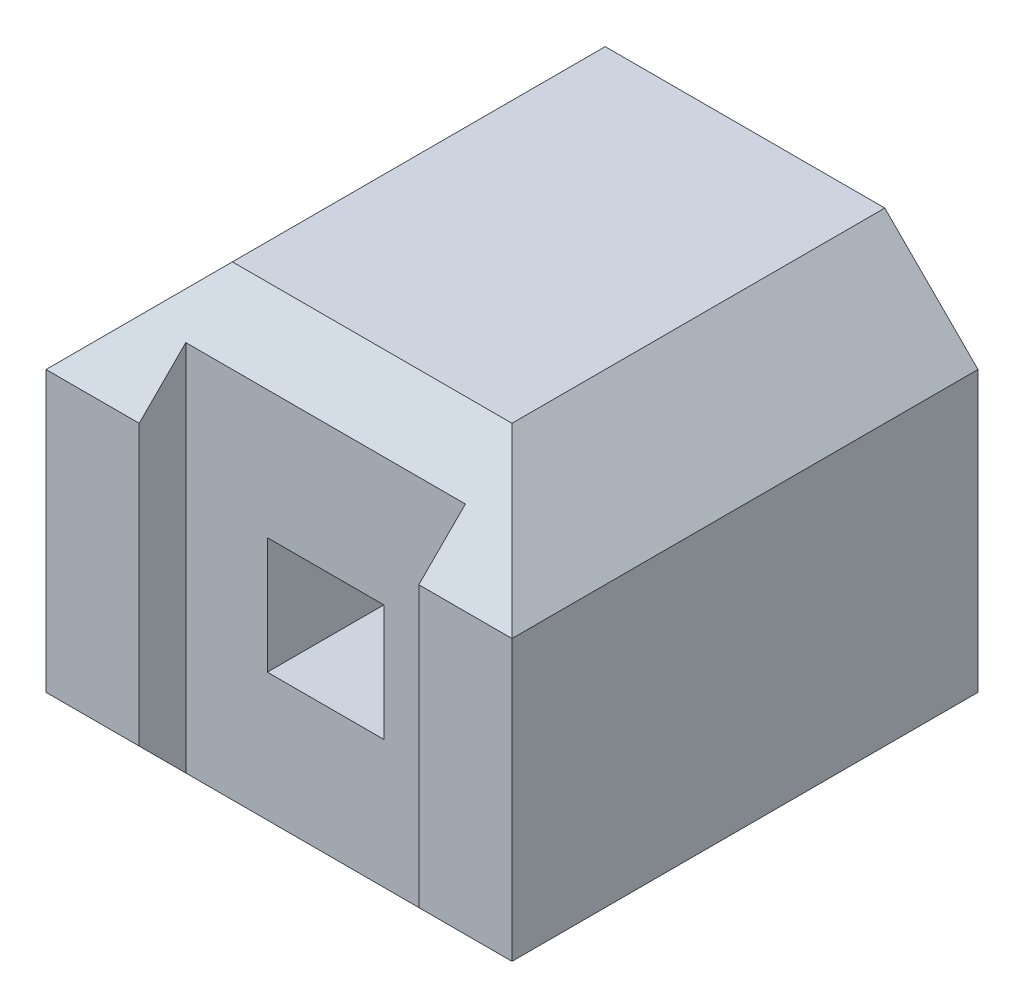
ISO-10303-21;
HEADER;
FILE_DESCRIPTION(('STEP AP214'),'2;1');
FILE_NAME('part.step','',(''),(''),'','','');
FILE_SCHEMA(('AUTOMOTIVE_DESIGN { 1 0 10303 214 1 1 1 1 }'));
ENDSEC;
DATA;
#1=APPLICATION_CONTEXT('core data for automotive mechanical design processes');
#2=APPLICATION_PROTOCOL_DEFINITION('international standard','automotive_design',2000,#1);
#3=PRODUCT_CONTEXT('',#1,'mechanical');
#4=PRODUCT('Part','Part','',(#3));
#5=PRODUCT_RELATED_PRODUCT_CATEGORY('part','',(#4));
#6=PRODUCT_DEFINITION_FORMATION('','',#4);
#7=PRODUCT_DEFINITION_CONTEXT('part definition',#1,'design');
#8=PRODUCT_DEFINITION('design','',#6,#7);
#9=PRODUCT_DEFINITION_SHAPE('','',#8);
#10=(LENGTH_UNIT() NAMED_UNIT(*) SI_UNIT(.MILLI.,.METRE.));
#11=(NAMED_UNIT(*) PLANE_ANGLE_UNIT() SI_UNIT($,.RADIAN.));
#12=(NAMED_UNIT(*) SI_UNIT($,.STERADIAN.) SOLID_ANGLE_UNIT());
#13=UNCERTAINTY_MEASURE_WITH_UNIT(LENGTH_MEASURE(1.E-05),#10,'distance_accuracy_value','');
#14=(GEOMETRIC_REPRESENTATION_CONTEXT(3) GLOBAL_UNCERTAINTY_ASSIGNED_CONTEXT((#13)) GLOBAL_UNIT_ASSIGNED_CONTEXT((#10,
#11,#12)) REPRESENTATION_CONTEXT('',''));
#15=CARTESIAN_POINT('',(0.,0.,0.));
#16=DIRECTION('',(0.,0.,1.));
#17=DIRECTION('',(1.,0.,0.));
#18=AXIS2_PLACEMENT_3D('',#15,#16,#17);
#19=CARTESIAN_POINT('',(1.27,8.89,2.54));
#20=DIRECTION('',(-1.,0.,0.));
#21=DIRECTION('',(0.,0.,1.));
#22=AXIS2_PLACEMENT_3D('',#19,#20,#21);
#23=PLANE('',#22);
#24=DIRECTION('',(0.,0.,1.));
#25=VECTOR('',#24,1.);
#26=CARTESIAN_POINT('',(1.27,10.922,2.54));
#27=LINE('',#26,#25);
#28=CARTESIAN_POINT('',(1.27,10.922,0.));
#29=VERTEX_POINT('',#28);
#30=CARTESIAN_POINT('',(1.27,10.922,2.54));
#31=VERTEX_POINT('',#30);
#32=EDGE_CURVE('E158',#29,#31,#27,.T.);
#33=ORIENTED_EDGE('',*,*,#32,.T.);
#34=DIRECTION('',(0.,1.,0.));
#35=VECTOR('',#34,1.);
#36=CARTESIAN_POINT('',(1.27,0.,2.54));
#37=LINE('',#36,#35);
#38=CARTESIAN_POINT('',(1.27,9.398,2.54));
#39=VERTEX_POINT('',#38);
#40=EDGE_CURVE('E127',#39,#31,#37,.T.);
#41=ORIENTED_EDGE('',*,*,#40,.F.);
#42=DIRECTION('',(0.,0.,1.));
#43=VECTOR('',#42,1.);
#44=CARTESIAN_POINT('',(1.27,9.398,2.54));
#45=LINE('',#44,#43);
#46=CARTESIAN_POINT('',(1.27,9.398,0.));
#47=VERTEX_POINT('',#46);
#48=EDGE_CURVE('E151',#39,#47,#45,.F.);
#49=ORIENTED_EDGE('',*,*,#48,.T.);
#50=DIRECTION('',(0.,1.,0.));
#51=VECTOR('',#50,1.);
#52=CARTESIAN_POINT('',(1.27,8.89,0.));
#53=LINE('',#52,#51);
#54=EDGE_CURVE('E19',#29,#47,#53,.F.);
#55=ORIENTED_EDGE('',*,*,#54,.F.);
#56=EDGE_LOOP('',(#33,#41,#49,#55));
#57=FACE_BOUND('',#56,.T.);
#58=ADVANCED_FACE('F16',(#57),#23,.F.);
#59=CARTESIAN_POINT('',(0.,0.,2.54));
#60=DIRECTION('',(0.,0.,1.));
#61=DIRECTION('',(1.,0.,0.));
#62=AXIS2_PLACEMENT_3D('',#59,#60,#61);
#63=PLANE('',#62);
#64=ORIENTED_EDGE('',*,*,#40,.T.);
#65=DIRECTION('',(1.,0.,0.));
#66=VECTOR('',#65,1.);
#67=CARTESIAN_POINT('',(0.,10.922,2.54));
#68=LINE('',#67,#66);
#69=CARTESIAN_POINT('',(0.762,10.922,2.54));
#70=VERTEX_POINT('',#69);
#71=EDGE_CURVE('E155',#31,#70,#68,.F.);
#72=ORIENTED_EDGE('',*,*,#71,.T.);
#73=DIRECTION('',(0.,-1.,0.));
#74=VECTOR('',#73,1.);
#75=CARTESIAN_POINT('',(0.762,11.43,2.54));
#76=LINE('',#75,#74);
#77=CARTESIAN_POINT('',(0.762,9.398,2.54));
#78=VERTEX_POINT('',#77);
#79=EDGE_CURVE('E134',#78,#70,#76,.F.);
#80=ORIENTED_EDGE('',*,*,#79,.F.);
#81=DIRECTION('',(1.,0.,0.));
#82=VECTOR('',#81,1.);
#83=CARTESIAN_POINT('',(0.,9.398,2.54));
#84=LINE('',#83,#82);
#85=EDGE_CURVE('E130',#78,#39,#84,.T.);
#86=ORIENTED_EDGE('',*,*,#85,.T.);
#87=EDGE_LOOP('',(#64,#72,#80,#86));
#88=FACE_BOUND('',#87,.T.);
#89=ADVANCED_FACE('F132',(#88),#63,.T.);
#90=CARTESIAN_POINT('',(1.27,9.398,2.54));
#91=DIRECTION('',(-0.707106781186548,0.707106781186548,0.));
#92=DIRECTION('',(-0.707106781186548,-0.707106781186548,0.));
#93=AXIS2_PLACEMENT_3D('',#90,#91,#92);
#94=PLANE('',#93);
#95=ORIENTED_EDGE('',*,*,#48,.F.);
#96=DIRECTION('',(0.577350269189626,0.577350269189626,0.577350269189626));
#97=VECTOR('',#96,1.);
#98=CARTESIAN_POINT('',(0.762,8.89,2.032));
#99=LINE('',#98,#97);
#100=CARTESIAN_POINT('',(0.762,8.89,2.032));
#101=VERTEX_POINT('',#100);
#102=EDGE_CURVE('E138',#101,#39,#99,.T.);
#103=ORIENTED_EDGE('',*,*,#102,.F.);
#104=DIRECTION('',(0.,0.,1.));
#105=VECTOR('',#104,1.);
#106=CARTESIAN_POINT('',(0.762,8.89,2.54));
#107=LINE('',#106,#105);
#108=CARTESIAN_POINT('',(0.762,8.89,0.));
#109=VERTEX_POINT('',#108);
#110=EDGE_CURVE('E182',#101,#109,#107,.F.);
#111=ORIENTED_EDGE('',*,*,#110,.T.);
#112=DIRECTION('',(-0.707106781186548,-0.707106781186548,0.));
#113=VECTOR('',#112,1.);
#114=CARTESIAN_POINT('',(1.27,9.398,0.));
#115=LINE('',#114,#113);
#116=EDGE_CURVE('E153',#47,#109,#115,.T.);
#117=ORIENTED_EDGE('',*,*,#116,.F.);
#118=EDGE_LOOP('',(#95,#103,#111,#117));
#119=FACE_BOUND('',#118,.T.);
#120=ADVANCED_FACE('F152',(#119),#94,.F.);
#121=CARTESIAN_POINT('',(0.762,11.43,2.54));
#122=DIRECTION('',(-0.707106781186547,-0.707106781186548,0.));
#123=DIRECTION('',(0.707106781186548,-0.707106781186547,0.));
#124=AXIS2_PLACEMENT_3D('',#121,#122,#123);
#125=PLANE('',#124);
#126=DIRECTION('',(0.,0.,-1.));
#127=VECTOR('',#126,1.);
#128=CARTESIAN_POINT('',(0.762,11.43,2.54));
#129=LINE('',#128,#127);
#130=CARTESIAN_POINT('',(0.762,11.43,0.));
#131=VERTEX_POINT('',#130);
#132=CARTESIAN_POINT('',(0.762,11.43,2.032));
#133=VERTEX_POINT('',#132);
#134=EDGE_CURVE('E186',#131,#133,#129,.F.);
#135=ORIENTED_EDGE('',*,*,#134,.T.);
#136=DIRECTION('',(-0.577350269189626,0.577350269189625,-0.577350269189627));
#137=VECTOR('',#136,1.);
#138=CARTESIAN_POINT('',(1.27,10.922,2.54));
#139=LINE('',#138,#137);
#140=EDGE_CURVE('E165',#31,#133,#139,.T.);
#141=ORIENTED_EDGE('',*,*,#140,.F.);
#142=ORIENTED_EDGE('',*,*,#32,.F.);
#143=DIRECTION('',(0.707106781186548,-0.707106781186547,0.));
#144=VECTOR('',#143,1.);
#145=CARTESIAN_POINT('',(0.762,11.43,0.));
#146=LINE('',#145,#144);
#147=EDGE_CURVE('E167',#131,#29,#146,.T.);
#148=ORIENTED_EDGE('',*,*,#147,.F.);
#149=EDGE_LOOP('',(#135,#141,#142,#148));
#150=FACE_BOUND('',#149,.T.);
#151=ADVANCED_FACE('F357',(#150),#125,.F.);
#152=CARTESIAN_POINT('',(0.762,11.43,2.286));
#153=DIRECTION('',(-1.,0.,0.));
#154=DIRECTION('',(0.,-1.,0.));
#155=AXIS2_PLACEMENT_3D('',#152,#153,#154);
#156=PLANE('',#155);
#157=ORIENTED_EDGE('',*,*,#79,.T.);
#158=DIRECTION('',(0.,-0.707106781186547,0.707106781186548));
#159=VECTOR('',#158,1.);
#160=CARTESIAN_POINT('',(0.762,10.922,2.54));
#161=LINE('',#160,#159);
#162=CARTESIAN_POINT('',(0.762,11.176,2.286));
#163=VERTEX_POINT('',#162);
#164=EDGE_CURVE('E196',#163,#70,#161,.T.);
#165=ORIENTED_EDGE('',*,*,#164,.F.);
#166=DIRECTION('',(0.,1.,0.));
#167=VECTOR('',#166,1.);
#168=CARTESIAN_POINT('',(0.762,0.,2.286));
#169=LINE('',#168,#167);
#170=CARTESIAN_POINT('',(0.762,9.144,2.286));
#171=VERTEX_POINT('',#170);
#172=EDGE_CURVE('E211',#163,#171,#169,.F.);
#173=ORIENTED_EDGE('',*,*,#172,.T.);
#174=DIRECTION('',(0.,-0.707106781186547,-0.707106781186548));
#175=VECTOR('',#174,1.);
#176=CARTESIAN_POINT('',(0.762,9.398,2.54));
#177=LINE('',#176,#175);
#178=EDGE_CURVE('E146',#78,#171,#177,.T.);
#179=ORIENTED_EDGE('',*,*,#178,.F.);
#180=EDGE_LOOP('',(#157,#165,#173,#179));
#181=FACE_BOUND('',#180,.T.);
#182=ADVANCED_FACE('F292',(#181),#156,.T.);
#183=CARTESIAN_POINT('',(-0.762,8.89,2.286));
#184=DIRECTION('',(1.,0.,0.));
#185=DIRECTION('',(0.,0.,-1.));
#186=AXIS2_PLACEMENT_3D('',#183,#184,#185);
#187=PLANE('',#186);
#188=DIRECTION('',(0.,1.,0.));
#189=VECTOR('',#188,1.);
#190=CARTESIAN_POINT('',(-0.762,0.,2.286));
#191=LINE('',#190,#189);
#192=CARTESIAN_POINT('',(-0.762,9.144,2.286));
#193=VERTEX_POINT('',#192);
#194=CARTESIAN_POINT('',(-0.762,11.176,2.286));
#195=VERTEX_POINT('',#194);
#196=EDGE_CURVE('E217',#193,#195,#191,.T.);
#197=ORIENTED_EDGE('',*,*,#196,.T.);
#198=DIRECTION('',(0.,-0.707106781186547,0.707106781186548));
#199=VECTOR('',#198,1.);
#200=CARTESIAN_POINT('',(-0.762,10.922,2.54));
#201=LINE('',#200,#199);
#202=CARTESIAN_POINT('',(-0.762,10.922,2.54));
#203=VERTEX_POINT('',#202);
#204=EDGE_CURVE('E194',#203,#195,#201,.F.);
#205=ORIENTED_EDGE('',*,*,#204,.F.);
#206=DIRECTION('',(0.,1.,0.));
#207=VECTOR('',#206,1.);
#208=CARTESIAN_POINT('',(-0.762,8.89,2.54));
#209=LINE('',#208,#207);
#210=CARTESIAN_POINT('',(-0.762,9.398,2.54));
#211=VERTEX_POINT('',#210);
#212=EDGE_CURVE('E171',#203,#211,#209,.F.);
#213=ORIENTED_EDGE('',*,*,#212,.T.);
#214=DIRECTION('',(0.,-0.707106781186547,-0.707106781186548));
#215=VECTOR('',#214,1.);
#216=CARTESIAN_POINT('',(-0.762,9.398,2.54));
#217=LINE('',#216,#215);
#218=EDGE_CURVE('E176',#193,#211,#217,.F.);
#219=ORIENTED_EDGE('',*,*,#218,.F.);
#220=EDGE_LOOP('',(#197,#205,#213,#219));
#221=FACE_BOUND('',#220,.T.);
#222=ADVANCED_FACE('F283',(#221),#187,.T.);
#223=CARTESIAN_POINT('',(0.3175,9.8425,2.794));
#224=DIRECTION('',(0.,-1.,0.));
#225=DIRECTION('',(0.,0.,-1.));
#226=AXIS2_PLACEMENT_3D('',#223,#224,#225);
#227=PLANE('',#226);
#228=DIRECTION('',(-1.,0.,0.));
#229=VECTOR('',#228,1.);
#230=CARTESIAN_POINT('',(0.,9.8425,2.286));
#231=LINE('',#230,#229);
#232=CARTESIAN_POINT('',(-0.3175,9.8425,2.286));
#233=VERTEX_POINT('',#232);
#234=CARTESIAN_POINT('',(0.3175,9.8425,2.286));
#235=VERTEX_POINT('',#234);
#236=EDGE_CURVE('E209',#233,#235,#231,.F.);
#237=ORIENTED_EDGE('',*,*,#236,.T.);
#238=DIRECTION('',(0.,0.,-1.));
#239=VECTOR('',#238,1.);
#240=CARTESIAN_POINT('',(0.3175,9.8425,2.794));
#241=LINE('',#240,#239);
#242=CARTESIAN_POINT('',(0.3175,9.8425,0.));
#243=VERTEX_POINT('',#242);
#244=EDGE_CURVE('E228',#235,#243,#241,.T.);
#245=ORIENTED_EDGE('',*,*,#244,.T.);
#246=DIRECTION('',(1.,0.,0.));
#247=VECTOR('',#246,1.);
#248=CARTESIAN_POINT('',(0.3175,9.8425,0.));
#249=LINE('',#248,#247);
#250=CARTESIAN_POINT('',(-0.3175,9.8425,0.));
#251=VERTEX_POINT('',#250);
#252=EDGE_CURVE('E173',#251,#243,#249,.T.);
#253=ORIENTED_EDGE('',*,*,#252,.F.);
#254=DIRECTION('',(0.,0.,1.));
#255=VECTOR('',#254,1.);
#256=CARTESIAN_POINT('',(-0.3175,9.8425,2.794));
#257=LINE('',#256,#255);
#258=EDGE_CURVE('E204',#251,#233,#257,.T.);
#259=ORIENTED_EDGE('',*,*,#258,.T.);
#260=EDGE_LOOP('',(#237,#245,#253,#259));
#261=FACE_BOUND('',#260,.T.);
#262=ADVANCED_FACE('F281',(#261),#227,.F.);
#263=CARTESIAN_POINT('',(0.,9.398,2.54));
#264=DIRECTION('',(0.,-0.707106781186548,0.707106781186547));
#265=DIRECTION('',(0.,-0.707106781186547,-0.707106781186548));
#266=AXIS2_PLACEMENT_3D('',#263,#264,#265);
#267=PLANE('',#266);
#268=ORIENTED_EDGE('',*,*,#85,.F.);
#269=ORIENTED_EDGE('',*,*,#178,.T.);
#270=DIRECTION('',(-1.,0.,0.));
#271=VECTOR('',#270,1.);
#272=CARTESIAN_POINT('',(0.,9.144,2.286));
#273=LINE('',#272,#271);
#274=EDGE_CURVE('E214',#171,#193,#273,.T.);
#275=ORIENTED_EDGE('',*,*,#274,.T.);
#276=ORIENTED_EDGE('',*,*,#218,.T.);
#277=DIRECTION('',(1.,0.,0.));
#278=VECTOR('',#277,1.);
#279=CARTESIAN_POINT('',(0.,9.398,2.54));
#280=LINE('',#279,#278);
#281=CARTESIAN_POINT('',(-1.27,9.398,2.54));
#282=VERTEX_POINT('',#281);
#283=EDGE_CURVE('E147',#211,#282,#280,.F.);
#284=ORIENTED_EDGE('',*,*,#283,.T.);
#285=DIRECTION('',(0.577350269189626,-0.577350269189626,-0.577350269189626));
#286=VECTOR('',#285,1.);
#287=CARTESIAN_POINT('',(-1.27,9.398,2.54));
#288=LINE('',#287,#286);
#289=CARTESIAN_POINT('',(-0.762,8.89,2.032));
#290=VERTEX_POINT('',#289);
#291=EDGE_CURVE('E231',#282,#290,#288,.T.);
#292=ORIENTED_EDGE('',*,*,#291,.T.);
#293=DIRECTION('',(1.,0.,0.));
#294=VECTOR('',#293,1.);
#295=CARTESIAN_POINT('',(-1.27,8.89,2.032));
#296=LINE('',#295,#294);
#297=EDGE_CURVE('E142',#290,#101,#296,.T.);
#298=ORIENTED_EDGE('',*,*,#297,.T.);
#299=ORIENTED_EDGE('',*,*,#102,.T.);
#300=EDGE_LOOP('',(#268,#269,#275,#276,#284,#292,#298,#299));
#301=FACE_BOUND('',#300,.T.);
#302=ADVANCED_FACE('F140',(#301),#267,.T.);
#303=CARTESIAN_POINT('',(-1.27,8.89,2.54));
#304=DIRECTION('',(0.,1.,0.));
#305=DIRECTION('',(0.,0.,1.));
#306=AXIS2_PLACEMENT_3D('',#303,#304,#305);
#307=PLANE('',#306);
#308=ORIENTED_EDGE('',*,*,#110,.F.);
#309=ORIENTED_EDGE('',*,*,#297,.F.);
#310=DIRECTION('',(0.,0.,1.));
#311=VECTOR('',#310,1.);
#312=CARTESIAN_POINT('',(-0.762,8.89,2.54));
#313=LINE('',#312,#311);
#314=CARTESIAN_POINT('',(-0.762,8.89,0.));
#315=VERTEX_POINT('',#314);
#316=EDGE_CURVE('E233',#290,#315,#313,.F.);
#317=ORIENTED_EDGE('',*,*,#316,.T.);
#318=DIRECTION('',(1.,0.,0.));
#319=VECTOR('',#318,1.);
#320=CARTESIAN_POINT('',(-1.27,8.89,0.));
#321=LINE('',#320,#319);
#322=EDGE_CURVE('E184',#109,#315,#321,.F.);
#323=ORIENTED_EDGE('',*,*,#322,.F.);
#324=EDGE_LOOP('',(#308,#309,#317,#323));
#325=FACE_BOUND('',#324,.T.);
#326=ADVANCED_FACE('F290',(#325),#307,.F.);
#327=CARTESIAN_POINT('',(1.27,11.43,2.54));
#328=DIRECTION('',(0.,-1.,0.));
#329=DIRECTION('',(0.,0.,-1.));
#330=AXIS2_PLACEMENT_3D('',#327,#328,#329);
#331=PLANE('',#330);
#332=DIRECTION('',(0.,0.,1.));
#333=VECTOR('',#332,1.);
#334=CARTESIAN_POINT('',(-0.762000000000001,11.43,2.54));
#335=LINE('',#334,#333);
#336=CARTESIAN_POINT('',(-0.762,11.43,0.));
#337=VERTEX_POINT('',#336);
#338=CARTESIAN_POINT('',(-0.762,11.43,2.032));
#339=VERTEX_POINT('',#338);
#340=EDGE_CURVE('E238',#337,#339,#335,.T.);
#341=ORIENTED_EDGE('',*,*,#340,.T.);
#342=DIRECTION('',(1.,0.,0.));
#343=VECTOR('',#342,1.);
#344=CARTESIAN_POINT('',(0.,11.43,2.032));
#345=LINE('',#344,#343);
#346=EDGE_CURVE('E199',#133,#339,#345,.F.);
#347=ORIENTED_EDGE('',*,*,#346,.F.);
#348=ORIENTED_EDGE('',*,*,#134,.F.);
#349=DIRECTION('',(1.,0.,0.));
#350=VECTOR('',#349,1.);
#351=CARTESIAN_POINT('',(1.27,11.43,0.));
#352=LINE('',#351,#350);
#353=EDGE_CURVE('E189',#337,#131,#352,.T.);
#354=ORIENTED_EDGE('',*,*,#353,.F.);
#355=EDGE_LOOP('',(#341,#347,#348,#354));
#356=FACE_BOUND('',#355,.T.);
#357=ADVANCED_FACE('F328',(#356),#331,.F.);
#358=CARTESIAN_POINT('',(0.,10.922,2.54));
#359=DIRECTION('',(0.,0.707106781186548,0.707106781186547));
#360=DIRECTION('',(0.,-0.707106781186547,0.707106781186548));
#361=AXIS2_PLACEMENT_3D('',#358,#359,#360);
#362=PLANE('',#361);
#363=ORIENTED_EDGE('',*,*,#346,.T.);
#364=DIRECTION('',(-0.577350269189625,-0.577350269189626,0.577350269189626));
#365=VECTOR('',#364,1.);
#366=CARTESIAN_POINT('',(-0.762000000000001,11.43,2.032));
#367=LINE('',#366,#365);
#368=CARTESIAN_POINT('',(-1.27,10.922,2.54));
#369=VERTEX_POINT('',#368);
#370=EDGE_CURVE('E241',#339,#369,#367,.T.);
#371=ORIENTED_EDGE('',*,*,#370,.T.);
#372=DIRECTION('',(1.,0.,0.));
#373=VECTOR('',#372,1.);
#374=CARTESIAN_POINT('',(0.,10.922,2.54));
#375=LINE('',#374,#373);
#376=EDGE_CURVE('E192',#369,#203,#375,.T.);
#377=ORIENTED_EDGE('',*,*,#376,.T.);
#378=ORIENTED_EDGE('',*,*,#204,.T.);
#379=DIRECTION('',(-1.,0.,0.));
#380=VECTOR('',#379,1.);
#381=CARTESIAN_POINT('',(0.,11.176,2.286));
#382=LINE('',#381,#380);
#383=EDGE_CURVE('E220',#195,#163,#382,.F.);
#384=ORIENTED_EDGE('',*,*,#383,.T.);
#385=ORIENTED_EDGE('',*,*,#164,.T.);
#386=ORIENTED_EDGE('',*,*,#71,.F.);
#387=ORIENTED_EDGE('',*,*,#140,.T.);
#388=EDGE_LOOP('',(#363,#371,#377,#378,#384,#385,#386,#387));
#389=FACE_BOUND('',#388,.T.);
#390=ADVANCED_FACE('F325',(#389),#362,.T.);
#391=CARTESIAN_POINT('',(-0.3175,9.8425,2.794));
#392=DIRECTION('',(-1.,0.,0.));
#393=DIRECTION('',(0.,0.,1.));
#394=AXIS2_PLACEMENT_3D('',#391,#392,#393);
#395=PLANE('',#394);
#396=DIRECTION('',(0.,1.,0.));
#397=VECTOR('',#396,1.);
#398=CARTESIAN_POINT('',(-0.3175,0.,2.286));
#399=LINE('',#398,#397);
#400=CARTESIAN_POINT('',(-0.3175,10.4775,2.286));
#401=VERTEX_POINT('',#400);
#402=EDGE_CURVE('E206',#401,#233,#399,.F.);
#403=ORIENTED_EDGE('',*,*,#402,.T.);
#404=ORIENTED_EDGE('',*,*,#258,.F.);
#405=DIRECTION('',(0.,1.,0.));
#406=VECTOR('',#405,1.);
#407=CARTESIAN_POINT('',(-0.3175,9.8425,0.));
#408=LINE('',#407,#406);
#409=CARTESIAN_POINT('',(-0.3175,10.4775,0.));
#410=VERTEX_POINT('',#409);
#411=EDGE_CURVE('E201',#410,#251,#408,.F.);
#412=ORIENTED_EDGE('',*,*,#411,.F.);
#413=DIRECTION('',(0.,0.,1.));
#414=VECTOR('',#413,1.);
#415=CARTESIAN_POINT('',(-0.3175,10.4775,2.794));
#416=LINE('',#415,#414);
#417=EDGE_CURVE('E245',#410,#401,#416,.T.);
#418=ORIENTED_EDGE('',*,*,#417,.T.);
#419=EDGE_LOOP('',(#403,#404,#412,#418));
#420=FACE_BOUND('',#419,.T.);
#421=ADVANCED_FACE('F278',(#420),#395,.F.);
#422=CARTESIAN_POINT('',(0.,0.,2.286));
#423=DIRECTION('',(0.,0.,-1.));
#424=DIRECTION('',(-1.,0.,0.));
#425=AXIS2_PLACEMENT_3D('',#422,#423,#424);
#426=PLANE('',#425);
#427=ORIENTED_EDGE('',*,*,#196,.F.);
#428=ORIENTED_EDGE('',*,*,#274,.F.);
#429=ORIENTED_EDGE('',*,*,#172,.F.);
#430=ORIENTED_EDGE('',*,*,#383,.F.);
#431=EDGE_LOOP('',(#427,#428,#429,#430));
#432=FACE_BOUND('',#431,.T.);
#433=ORIENTED_EDGE('',*,*,#402,.F.);
#434=DIRECTION('',(1.,0.,0.));
#435=VECTOR('',#434,1.);
#436=CARTESIAN_POINT('',(-0.3175,10.4775,2.286));
#437=LINE('',#436,#435);
#438=CARTESIAN_POINT('',(0.3175,10.4775,2.286));
#439=VERTEX_POINT('',#438);
#440=EDGE_CURVE('E248',#401,#439,#437,.T.);
#441=ORIENTED_EDGE('',*,*,#440,.T.);
#442=DIRECTION('',(0.,1.,0.));
#443=VECTOR('',#442,1.);
#444=CARTESIAN_POINT('',(0.3175,10.4775,2.286));
#445=LINE('',#444,#443);
#446=EDGE_CURVE('E225',#439,#235,#445,.F.);
#447=ORIENTED_EDGE('',*,*,#446,.T.);
#448=ORIENTED_EDGE('',*,*,#236,.F.);
#449=EDGE_LOOP('',(#433,#441,#447,#448));
#450=FACE_BOUND('',#449,.T.);
#451=ADVANCED_FACE('F276',(#432,#450),#426,.F.);
#452=CARTESIAN_POINT('',(0.3175,10.4775,2.794));
#453=DIRECTION('',(1.,0.,0.));
#454=DIRECTION('',(0.,0.,-1.));
#455=AXIS2_PLACEMENT_3D('',#452,#453,#454);
#456=PLANE('',#455);
#457=ORIENTED_EDGE('',*,*,#446,.F.);
#458=DIRECTION('',(0.,0.,1.));
#459=VECTOR('',#458,1.);
#460=CARTESIAN_POINT('',(0.3175,10.4775,2.794));
#461=LINE('',#460,#459);
#462=CARTESIAN_POINT('',(0.3175,10.4775,0.));
#463=VERTEX_POINT('',#462);
#464=EDGE_CURVE('E251',#439,#463,#461,.F.);
#465=ORIENTED_EDGE('',*,*,#464,.T.);
#466=DIRECTION('',(0.,1.,0.));
#467=VECTOR('',#466,1.);
#468=CARTESIAN_POINT('',(0.3175,10.4775,0.));
#469=LINE('',#468,#467);
#470=EDGE_CURVE('E223',#243,#463,#469,.T.);
#471=ORIENTED_EDGE('',*,*,#470,.F.);
#472=ORIENTED_EDGE('',*,*,#244,.F.);
#473=EDGE_LOOP('',(#457,#465,#471,#472));
#474=FACE_BOUND('',#473,.T.);
#475=ADVANCED_FACE('F273',(#474),#456,.F.);
#476=CARTESIAN_POINT('',(-0.762,8.89,2.54));
#477=DIRECTION('',(0.707106781186547,0.707106781186548,0.));
#478=DIRECTION('',(-0.707106781186548,0.707106781186547,0.));
#479=AXIS2_PLACEMENT_3D('',#476,#477,#478);
#480=PLANE('',#479);
#481=ORIENTED_EDGE('',*,*,#316,.F.);
#482=ORIENTED_EDGE('',*,*,#291,.F.);
#483=DIRECTION('',(0.,0.,-1.));
#484=VECTOR('',#483,1.);
#485=CARTESIAN_POINT('',(-1.27,9.398,2.54));
#486=LINE('',#485,#484);
#487=CARTESIAN_POINT('',(-1.27,9.398,0.));
#488=VERTEX_POINT('',#487);
#489=EDGE_CURVE('E254',#282,#488,#486,.T.);
#490=ORIENTED_EDGE('',*,*,#489,.T.);
#491=DIRECTION('',(-0.707106781186548,0.707106781186547,0.));
#492=VECTOR('',#491,1.);
#493=CARTESIAN_POINT('',(-0.762,8.89,0.));
#494=LINE('',#493,#492);
#495=EDGE_CURVE('E236',#315,#488,#494,.T.);
#496=ORIENTED_EDGE('',*,*,#495,.F.);
#497=EDGE_LOOP('',(#481,#482,#490,#496));
#498=FACE_BOUND('',#497,.T.);
#499=ADVANCED_FACE('F314',(#498),#480,.F.);
#500=CARTESIAN_POINT('',(-1.27,10.922,2.54));
#501=DIRECTION('',(0.707106781186548,-0.707106781186548,0.));
#502=DIRECTION('',(0.707106781186548,0.707106781186548,0.));
#503=AXIS2_PLACEMENT_3D('',#500,#501,#502);
#504=PLANE('',#503);
#505=DIRECTION('',(0.,0.,-1.));
#506=VECTOR('',#505,1.);
#507=CARTESIAN_POINT('',(-1.27,10.922,2.54));
#508=LINE('',#507,#506);
#509=CARTESIAN_POINT('',(-1.27,10.922,0.));
#510=VERTEX_POINT('',#509);
#511=EDGE_CURVE('E257',#510,#369,#508,.F.);
#512=ORIENTED_EDGE('',*,*,#511,.T.);
#513=ORIENTED_EDGE('',*,*,#370,.F.);
#514=ORIENTED_EDGE('',*,*,#340,.F.);
#515=DIRECTION('',(0.707106781186548,0.707106781186548,0.));
#516=VECTOR('',#515,1.);
#517=CARTESIAN_POINT('',(-1.27,10.922,0.));
#518=LINE('',#517,#516);
#519=EDGE_CURVE('E34',#510,#337,#518,.T.);
#520=ORIENTED_EDGE('',*,*,#519,.F.);
#521=EDGE_LOOP('',(#512,#513,#514,#520));
#522=FACE_BOUND('',#521,.T.);
#523=ADVANCED_FACE('F310',(#522),#504,.F.);
#524=CARTESIAN_POINT('',(0.,0.,2.54));
#525=DIRECTION('',(0.,0.,1.));
#526=DIRECTION('',(1.,0.,0.));
#527=AXIS2_PLACEMENT_3D('',#524,#525,#526);
#528=PLANE('',#527);
#529=DIRECTION('',(0.,1.,0.));
#530=VECTOR('',#529,1.);
#531=CARTESIAN_POINT('',(-1.27,11.43,2.54));
#532=LINE('',#531,#530);
#533=EDGE_CURVE('E259',#369,#282,#532,.F.);
#534=ORIENTED_EDGE('',*,*,#533,.T.);
#535=ORIENTED_EDGE('',*,*,#283,.F.);
#536=ORIENTED_EDGE('',*,*,#212,.F.);
#537=ORIENTED_EDGE('',*,*,#376,.F.);
#538=EDGE_LOOP('',(#534,#535,#536,#537));
#539=FACE_BOUND('',#538,.T.);
#540=ADVANCED_FACE('F307',(#539),#528,.T.);
#541=CARTESIAN_POINT('',(-0.3175,10.4775,2.794));
#542=DIRECTION('',(0.,1.,0.));
#543=DIRECTION('',(0.,0.,1.));
#544=AXIS2_PLACEMENT_3D('',#541,#542,#543);
#545=PLANE('',#544);
#546=ORIENTED_EDGE('',*,*,#440,.F.);
#547=ORIENTED_EDGE('',*,*,#417,.F.);
#548=DIRECTION('',(1.,0.,0.));
#549=VECTOR('',#548,1.);
#550=CARTESIAN_POINT('',(0.,10.4775,0.));
#551=LINE('',#550,#549);
#552=EDGE_CURVE('E25',#410,#463,#551,.T.);
#553=ORIENTED_EDGE('',*,*,#552,.T.);
#554=ORIENTED_EDGE('',*,*,#464,.F.);
#555=EDGE_LOOP('',(#546,#547,#553,#554));
#556=FACE_BOUND('',#555,.T.);
#557=ADVANCED_FACE('F268',(#556),#545,.F.);
#558=CARTESIAN_POINT('',(-1.27,11.43,2.54));
#559=DIRECTION('',(1.,0.,0.));
#560=DIRECTION('',(0.,0.,-1.));
#561=AXIS2_PLACEMENT_3D('',#558,#559,#560);
#562=PLANE('',#561);
#563=ORIENTED_EDGE('',*,*,#511,.F.);
#564=DIRECTION('',(0.,1.,0.));
#565=VECTOR('',#564,1.);
#566=CARTESIAN_POINT('',(-1.27,0.,0.));
#567=LINE('',#566,#565);
#568=EDGE_CURVE('E11',#510,#488,#567,.F.);
#569=ORIENTED_EDGE('',*,*,#568,.T.);
#570=ORIENTED_EDGE('',*,*,#489,.F.);
#571=ORIENTED_EDGE('',*,*,#533,.F.);
#572=EDGE_LOOP('',(#563,#569,#570,#571));
#573=FACE_BOUND('',#572,.T.);
#574=ADVANCED_FACE('F296',(#573),#562,.F.);
#575=CARTESIAN_POINT('',(0.,0.,0.));
#576=DIRECTION('',(0.,0.,1.));
#577=DIRECTION('',(1.,0.,0.));
#578=AXIS2_PLACEMENT_3D('',#575,#576,#577);
#579=PLANE('',#578);
#580=ORIENTED_EDGE('',*,*,#519,.T.);
#581=ORIENTED_EDGE('',*,*,#353,.T.);
#582=ORIENTED_EDGE('',*,*,#147,.T.);
#583=ORIENTED_EDGE('',*,*,#54,.T.);
#584=ORIENTED_EDGE('',*,*,#116,.T.);
#585=ORIENTED_EDGE('',*,*,#322,.T.);
#586=ORIENTED_EDGE('',*,*,#495,.T.);
#587=ORIENTED_EDGE('',*,*,#568,.F.);
#588=EDGE_LOOP('',(#580,#581,#582,#583,#584,#585,#586,#587));
#589=FACE_BOUND('',#588,.T.);
#590=ORIENTED_EDGE('',*,*,#411,.T.);
#591=ORIENTED_EDGE('',*,*,#252,.T.);
#592=ORIENTED_EDGE('',*,*,#470,.T.);
#593=ORIENTED_EDGE('',*,*,#552,.F.);
#594=EDGE_LOOP('',(#590,#591,#592,#593));
#595=FACE_BOUND('',#594,.T.);
#596=ADVANCED_FACE('F270',(#589,#595),#579,.F.);
#597=CLOSED_SHELL('',(#58,#89,#120,#151,#182,#222,#262,#302,#326,#357,#390,#421,#451,#475,#499,
#523,#540,#557,#574,#596));
#598=MANIFOLD_SOLID_BREP('B1',#597);
#599=ADVANCED_BREP_SHAPE_REPRESENTATION('',(#18,#598),#14);
#600=SHAPE_DEFINITION_REPRESENTATION(#9,#599);
ENDSEC;
END-ISO-10303-21;
